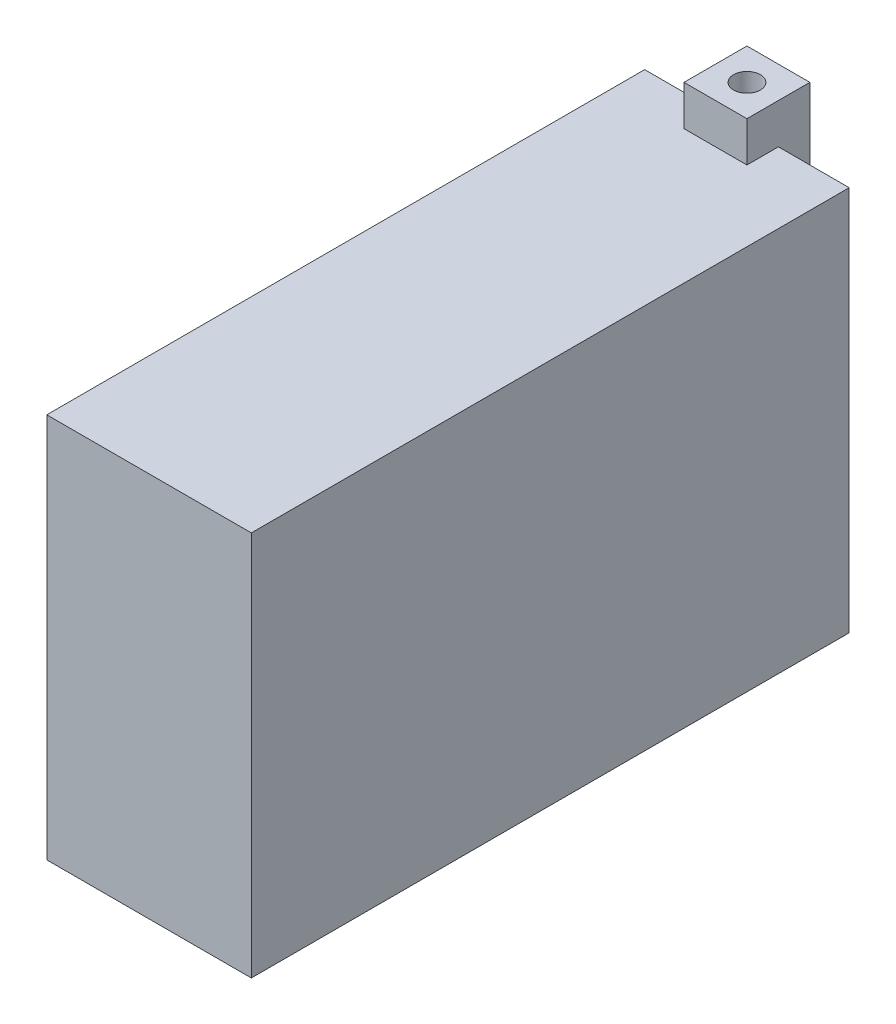
ISO-10303-21;
HEADER;
FILE_DESCRIPTION(('STEP AP214'),'2;1');
FILE_NAME('part.step','',(''),(''),'','','');
FILE_SCHEMA(('AUTOMOTIVE_DESIGN { 1 0 10303 214 1 1 1 1 }'));
ENDSEC;
DATA;
#1=APPLICATION_CONTEXT('core data for automotive mechanical design processes');
#2=APPLICATION_PROTOCOL_DEFINITION('international standard','automotive_design',2000,#1);
#3=PRODUCT_CONTEXT('',#1,'mechanical');
#4=PRODUCT('Part','Part','',(#3));
#5=PRODUCT_RELATED_PRODUCT_CATEGORY('part','',(#4));
#6=PRODUCT_DEFINITION_FORMATION('','',#4);
#7=PRODUCT_DEFINITION_CONTEXT('part definition',#1,'design');
#8=PRODUCT_DEFINITION('design','',#6,#7);
#9=PRODUCT_DEFINITION_SHAPE('','',#8);
#10=(LENGTH_UNIT() NAMED_UNIT(*) SI_UNIT(.MILLI.,.METRE.));
#11=(NAMED_UNIT(*) PLANE_ANGLE_UNIT() SI_UNIT($,.RADIAN.));
#12=(NAMED_UNIT(*) SI_UNIT($,.STERADIAN.) SOLID_ANGLE_UNIT());
#13=UNCERTAINTY_MEASURE_WITH_UNIT(LENGTH_MEASURE(1.E-05),#10,'distance_accuracy_value','');
#14=(GEOMETRIC_REPRESENTATION_CONTEXT(3) GLOBAL_UNCERTAINTY_ASSIGNED_CONTEXT((#13)) GLOBAL_UNIT_ASSIGNED_CONTEXT((#10,
#11,#12)) REPRESENTATION_CONTEXT('',''));
#15=CARTESIAN_POINT('',(0.,0.,0.));
#16=DIRECTION('',(0.,0.,1.));
#17=DIRECTION('',(1.,0.,0.));
#18=AXIS2_PLACEMENT_3D('',#15,#16,#17);
#19=CARTESIAN_POINT('',(-65.,-122.5,-190.));
#20=DIRECTION('',(0.,0.,-1.));
#21=DIRECTION('',(-1.,0.,0.));
#22=AXIS2_PLACEMENT_3D('',#19,#20,#21);
#23=PLANE('',#22);
#24=DIRECTION('',(0.,-1.,0.));
#25=VECTOR('',#24,1.);
#26=CARTESIAN_POINT('',(8.50000000000005,172.041630560343,-190.));
#27=LINE('',#26,#25);
#28=CARTESIAN_POINT('',(8.50000000000005,88.,-190.));
#29=VERTEX_POINT('',#28);
#30=CARTESIAN_POINT('',(8.50000000000005,-88.,-190.));
#31=VERTEX_POINT('',#30);
#32=EDGE_CURVE('E163',#29,#31,#27,.T.);
#33=ORIENTED_EDGE('',*,*,#32,.F.);
#34=DIRECTION('',(-1.,0.,0.));
#35=VECTOR('',#34,1.);
#36=CARTESIAN_POINT('',(-20.,88.,-190.));
#37=LINE('',#36,#35);
#38=CARTESIAN_POINT('',(20.,88.,-190.));
#39=VERTEX_POINT('',#38);
#40=EDGE_CURVE('E171',#39,#29,#37,.T.);
#41=ORIENTED_EDGE('',*,*,#40,.F.);
#42=DIRECTION('',(0.,-1.,0.));
#43=VECTOR('',#42,1.);
#44=CARTESIAN_POINT('',(20.,148.,-190.));
#45=LINE('',#44,#43);
#46=CARTESIAN_POINT('',(20.,122.5,-190.));
#47=VERTEX_POINT('',#46);
#48=EDGE_CURVE('E182',#47,#39,#45,.T.);
#49=ORIENTED_EDGE('',*,*,#48,.F.);
#50=DIRECTION('',(1.,0.,0.));
#51=VECTOR('',#50,1.);
#52=CARTESIAN_POINT('',(-65.,122.5,-190.));
#53=LINE('',#52,#51);
#54=CARTESIAN_POINT('',(65.,122.5,-190.));
#55=VERTEX_POINT('',#54);
#56=EDGE_CURVE('E283',#47,#55,#53,.T.);
#57=ORIENTED_EDGE('',*,*,#56,.T.);
#58=DIRECTION('',(0.,1.,0.));
#59=VECTOR('',#58,1.);
#60=CARTESIAN_POINT('',(65.,-122.5,-190.));
#61=LINE('',#60,#59);
#62=CARTESIAN_POINT('',(65.,-122.5,-190.));
#63=VERTEX_POINT('',#62);
#64=EDGE_CURVE('E258',#63,#55,#61,.T.);
#65=ORIENTED_EDGE('',*,*,#64,.F.);
#66=DIRECTION('',(1.,0.,0.));
#67=VECTOR('',#66,1.);
#68=CARTESIAN_POINT('',(-65.,-122.5,-190.));
#69=LINE('',#68,#67);
#70=CARTESIAN_POINT('',(20.,-122.5,-190.));
#71=VERTEX_POINT('',#70);
#72=EDGE_CURVE('E286',#71,#63,#69,.T.);
#73=ORIENTED_EDGE('',*,*,#72,.F.);
#74=DIRECTION('',(0.,1.,0.));
#75=VECTOR('',#74,1.);
#76=CARTESIAN_POINT('',(20.,-148.,-190.));
#77=LINE('',#76,#75);
#78=CARTESIAN_POINT('',(20.,-88.,-190.));
#79=VERTEX_POINT('',#78);
#80=EDGE_CURVE('E46',#71,#79,#77,.T.);
#81=ORIENTED_EDGE('',*,*,#80,.T.);
#82=DIRECTION('',(-1.,0.,0.));
#83=VECTOR('',#82,1.);
#84=CARTESIAN_POINT('',(-20.,-88.,-190.));
#85=LINE('',#84,#83);
#86=EDGE_CURVE('E174',#79,#31,#85,.T.);
#87=ORIENTED_EDGE('',*,*,#86,.T.);
#88=EDGE_LOOP('',(#33,#41,#49,#57,#65,#73,#81,#87));
#89=FACE_BOUND('',#88,.T.);
#90=ADVANCED_FACE('F38',(#89),#23,.T.);
#91=DIRECTION('',(0.,-1.,0.));
#92=VECTOR('',#91,1.);
#93=CARTESIAN_POINT('',(-8.49999999999996,172.041630560343,-190.));
#94=LINE('',#93,#92);
#95=CARTESIAN_POINT('',(-8.49999999999996,-88.,-190.));
#96=VERTEX_POINT('',#95);
#97=CARTESIAN_POINT('',(-8.49999999999996,88.,-190.));
#98=VERTEX_POINT('',#97);
#99=EDGE_CURVE('E53',#96,#98,#94,.F.);
#100=ORIENTED_EDGE('',*,*,#99,.F.);
#101=CARTESIAN_POINT('',(-20.,-88.,-190.));
#102=VERTEX_POINT('',#101);
#103=EDGE_CURVE('E229',#96,#102,#85,.T.);
#104=ORIENTED_EDGE('',*,*,#103,.T.);
#105=DIRECTION('',(0.,-1.,0.));
#106=VECTOR('',#105,1.);
#107=CARTESIAN_POINT('',(-20.,-148.,-190.));
#108=LINE('',#107,#106);
#109=CARTESIAN_POINT('',(-20.,-122.5,-190.));
#110=VERTEX_POINT('',#109);
#111=EDGE_CURVE('E212',#102,#110,#108,.T.);
#112=ORIENTED_EDGE('',*,*,#111,.T.);
#113=CARTESIAN_POINT('',(-65.,-122.5,-190.));
#114=VERTEX_POINT('',#113);
#115=EDGE_CURVE('E231',#114,#110,#69,.T.);
#116=ORIENTED_EDGE('',*,*,#115,.F.);
#117=DIRECTION('',(0.,1.,0.));
#118=VECTOR('',#117,1.);
#119=CARTESIAN_POINT('',(-65.,-122.5,-190.));
#120=LINE('',#119,#118);
#121=CARTESIAN_POINT('',(-65.,122.5,-190.));
#122=VERTEX_POINT('',#121);
#123=EDGE_CURVE('E271',#114,#122,#120,.T.);
#124=ORIENTED_EDGE('',*,*,#123,.T.);
#125=CARTESIAN_POINT('',(-20.,122.5,-190.));
#126=VERTEX_POINT('',#125);
#127=EDGE_CURVE('E290',#122,#126,#53,.T.);
#128=ORIENTED_EDGE('',*,*,#127,.T.);
#129=DIRECTION('',(0.,1.,0.));
#130=VECTOR('',#129,1.);
#131=CARTESIAN_POINT('',(-20.,148.,-190.));
#132=LINE('',#131,#130);
#133=CARTESIAN_POINT('',(-20.,88.,-190.));
#134=VERTEX_POINT('',#133);
#135=EDGE_CURVE('E187',#134,#126,#132,.T.);
#136=ORIENTED_EDGE('',*,*,#135,.F.);
#137=EDGE_CURVE('E183',#98,#134,#37,.T.);
#138=ORIENTED_EDGE('',*,*,#137,.F.);
#139=EDGE_LOOP('',(#100,#104,#112,#116,#124,#128,#136,#138));
#140=FACE_BOUND('',#139,.T.);
#141=ADVANCED_FACE('F40',(#140),#23,.T.);
#142=CARTESIAN_POINT('',(-65.,-122.5,190.));
#143=DIRECTION('',(0.,-1.,0.));
#144=DIRECTION('',(0.,0.,-1.));
#145=AXIS2_PLACEMENT_3D('',#142,#143,#144);
#146=PLANE('',#145);
#147=DIRECTION('',(1.,0.,0.));
#148=VECTOR('',#147,1.);
#149=CARTESIAN_POINT('',(20.,-122.5,-170.));
#150=LINE('',#149,#148);
#151=CARTESIAN_POINT('',(-20.,-122.5,-170.));
#152=VERTEX_POINT('',#151);
#153=CARTESIAN_POINT('',(20.,-122.5,-170.));
#154=VERTEX_POINT('',#153);
#155=EDGE_CURVE('E241',#152,#154,#150,.T.);
#156=ORIENTED_EDGE('',*,*,#155,.T.);
#157=DIRECTION('',(0.,0.,-1.));
#158=VECTOR('',#157,1.);
#159=CARTESIAN_POINT('',(20.,-122.5,-190.));
#160=LINE('',#159,#158);
#161=EDGE_CURVE('E236',#154,#71,#160,.T.);
#162=ORIENTED_EDGE('',*,*,#161,.T.);
#163=ORIENTED_EDGE('',*,*,#72,.T.);
#164=DIRECTION('',(0.,0.,-1.));
#165=VECTOR('',#164,1.);
#166=CARTESIAN_POINT('',(65.,-122.5,190.));
#167=LINE('',#166,#165);
#168=CARTESIAN_POINT('',(65.,-122.5,190.));
#169=VERTEX_POINT('',#168);
#170=EDGE_CURVE('E268',#169,#63,#167,.T.);
#171=ORIENTED_EDGE('',*,*,#170,.F.);
#172=DIRECTION('',(1.,0.,0.));
#173=VECTOR('',#172,1.);
#174=CARTESIAN_POINT('',(-65.,-122.5,190.));
#175=LINE('',#174,#173);
#176=CARTESIAN_POINT('',(-65.,-122.5,190.));
#177=VERTEX_POINT('',#176);
#178=EDGE_CURVE('E287',#177,#169,#175,.T.);
#179=ORIENTED_EDGE('',*,*,#178,.F.);
#180=DIRECTION('',(0.,0.,-1.));
#181=VECTOR('',#180,1.);
#182=CARTESIAN_POINT('',(-65.,-122.5,190.));
#183=LINE('',#182,#181);
#184=EDGE_CURVE('E280',#177,#114,#183,.T.);
#185=ORIENTED_EDGE('',*,*,#184,.T.);
#186=ORIENTED_EDGE('',*,*,#115,.T.);
#187=DIRECTION('',(0.,0.,1.));
#188=VECTOR('',#187,1.);
#189=CARTESIAN_POINT('',(-20.,-122.5,-190.));
#190=LINE('',#189,#188);
#191=EDGE_CURVE('E250',#110,#152,#190,.T.);
#192=ORIENTED_EDGE('',*,*,#191,.T.);
#193=EDGE_LOOP('',(#156,#162,#163,#171,#179,#185,#186,#192));
#194=FACE_BOUND('',#193,.T.);
#195=ADVANCED_FACE('F303',(#194),#146,.T.);
#196=CARTESIAN_POINT('',(-65.,-122.5,190.));
#197=DIRECTION('',(0.,0.,1.));
#198=DIRECTION('',(1.,0.,0.));
#199=AXIS2_PLACEMENT_3D('',#196,#197,#198);
#200=PLANE('',#199);
#201=ORIENTED_EDGE('',*,*,#178,.T.);
#202=DIRECTION('',(0.,-1.,0.));
#203=VECTOR('',#202,1.);
#204=CARTESIAN_POINT('',(65.,-122.5,190.));
#205=LINE('',#204,#203);
#206=CARTESIAN_POINT('',(65.,122.5,190.));
#207=VERTEX_POINT('',#206);
#208=EDGE_CURVE('E265',#207,#169,#205,.T.);
#209=ORIENTED_EDGE('',*,*,#208,.F.);
#210=DIRECTION('',(1.,0.,0.));
#211=VECTOR('',#210,1.);
#212=CARTESIAN_POINT('',(-65.,122.5,190.));
#213=LINE('',#212,#211);
#214=CARTESIAN_POINT('',(-65.,122.5,190.));
#215=VERTEX_POINT('',#214);
#216=EDGE_CURVE('E289',#215,#207,#213,.T.);
#217=ORIENTED_EDGE('',*,*,#216,.F.);
#218=DIRECTION('',(0.,-1.,0.));
#219=VECTOR('',#218,1.);
#220=CARTESIAN_POINT('',(-65.,-122.5,190.));
#221=LINE('',#220,#219);
#222=EDGE_CURVE('E277',#215,#177,#221,.T.);
#223=ORIENTED_EDGE('',*,*,#222,.T.);
#224=EDGE_LOOP('',(#201,#209,#217,#223));
#225=FACE_BOUND('',#224,.T.);
#226=ADVANCED_FACE('F372',(#225),#200,.T.);
#227=CARTESIAN_POINT('',(-65.,122.5,190.));
#228=DIRECTION('',(0.,1.,0.));
#229=DIRECTION('',(0.,0.,1.));
#230=AXIS2_PLACEMENT_3D('',#227,#228,#229);
#231=PLANE('',#230);
#232=DIRECTION('',(0.,0.,-1.));
#233=VECTOR('',#232,1.);
#234=CARTESIAN_POINT('',(20.,122.5,-190.));
#235=LINE('',#234,#233);
#236=CARTESIAN_POINT('',(20.,122.5,-170.));
#237=VERTEX_POINT('',#236);
#238=EDGE_CURVE('E60',#237,#47,#235,.T.);
#239=ORIENTED_EDGE('',*,*,#238,.F.);
#240=DIRECTION('',(1.,0.,0.));
#241=VECTOR('',#240,1.);
#242=CARTESIAN_POINT('',(20.,122.5,-170.));
#243=LINE('',#242,#241);
#244=CARTESIAN_POINT('',(-20.,122.5,-170.));
#245=VERTEX_POINT('',#244);
#246=EDGE_CURVE('E205',#245,#237,#243,.T.);
#247=ORIENTED_EDGE('',*,*,#246,.F.);
#248=DIRECTION('',(0.,0.,1.));
#249=VECTOR('',#248,1.);
#250=CARTESIAN_POINT('',(-20.,122.5,-190.));
#251=LINE('',#250,#249);
#252=EDGE_CURVE('E199',#126,#245,#251,.T.);
#253=ORIENTED_EDGE('',*,*,#252,.F.);
#254=ORIENTED_EDGE('',*,*,#127,.F.);
#255=DIRECTION('',(0.,0.,1.));
#256=VECTOR('',#255,1.);
#257=CARTESIAN_POINT('',(-65.,122.5,190.));
#258=LINE('',#257,#256);
#259=EDGE_CURVE('E274',#122,#215,#258,.T.);
#260=ORIENTED_EDGE('',*,*,#259,.T.);
#261=ORIENTED_EDGE('',*,*,#216,.T.);
#262=DIRECTION('',(0.,0.,1.));
#263=VECTOR('',#262,1.);
#264=CARTESIAN_POINT('',(65.,122.5,190.));
#265=LINE('',#264,#263);
#266=EDGE_CURVE('E262',#55,#207,#265,.T.);
#267=ORIENTED_EDGE('',*,*,#266,.F.);
#268=ORIENTED_EDGE('',*,*,#56,.F.);
#269=EDGE_LOOP('',(#239,#247,#253,#254,#260,#261,#267,#268));
#270=FACE_BOUND('',#269,.T.);
#271=ADVANCED_FACE('F297',(#270),#231,.T.);
#272=CARTESIAN_POINT('',(-65.,0.,0.));
#273=DIRECTION('',(-1.,0.,0.));
#274=DIRECTION('',(0.,0.,1.));
#275=AXIS2_PLACEMENT_3D('',#272,#273,#274);
#276=PLANE('',#275);
#277=ORIENTED_EDGE('',*,*,#123,.F.);
#278=ORIENTED_EDGE('',*,*,#184,.F.);
#279=ORIENTED_EDGE('',*,*,#222,.F.);
#280=ORIENTED_EDGE('',*,*,#259,.F.);
#281=EDGE_LOOP('',(#277,#278,#279,#280));
#282=FACE_BOUND('',#281,.T.);
#283=ADVANCED_FACE('F369',(#282),#276,.T.);
#284=CARTESIAN_POINT('',(65.,0.,0.));
#285=DIRECTION('',(-1.,0.,0.));
#286=DIRECTION('',(0.,0.,1.));
#287=AXIS2_PLACEMENT_3D('',#284,#285,#286);
#288=PLANE('',#287);
#289=ORIENTED_EDGE('',*,*,#64,.T.);
#290=ORIENTED_EDGE('',*,*,#266,.T.);
#291=ORIENTED_EDGE('',*,*,#208,.T.);
#292=ORIENTED_EDGE('',*,*,#170,.T.);
#293=EDGE_LOOP('',(#289,#290,#291,#292));
#294=FACE_BOUND('',#293,.T.);
#295=ADVANCED_FACE('F300',(#294),#288,.F.);
#296=CARTESIAN_POINT('',(20.,-148.,-190.));
#297=DIRECTION('',(1.,0.,0.));
#298=DIRECTION('',(0.,0.,-1.));
#299=AXIS2_PLACEMENT_3D('',#296,#297,#298);
#300=PLANE('',#299);
#301=ORIENTED_EDGE('',*,*,#161,.F.);
#302=DIRECTION('',(0.,1.,0.));
#303=VECTOR('',#302,1.);
#304=CARTESIAN_POINT('',(20.,-148.,-170.));
#305=LINE('',#304,#303);
#306=CARTESIAN_POINT('',(20.,-148.,-170.));
#307=VERTEX_POINT('',#306);
#308=EDGE_CURVE('E255',#307,#154,#305,.T.);
#309=ORIENTED_EDGE('',*,*,#308,.F.);
#310=DIRECTION('',(0.,0.,-1.));
#311=VECTOR('',#310,1.);
#312=CARTESIAN_POINT('',(20.,-148.,-190.));
#313=LINE('',#312,#311);
#314=CARTESIAN_POINT('',(20.,-148.,-210.));
#315=VERTEX_POINT('',#314);
#316=EDGE_CURVE('E238',#307,#315,#313,.T.);
#317=ORIENTED_EDGE('',*,*,#316,.T.);
#318=DIRECTION('',(0.,1.,0.));
#319=VECTOR('',#318,1.);
#320=CARTESIAN_POINT('',(20.,-148.,-210.));
#321=LINE('',#320,#319);
#322=CARTESIAN_POINT('',(20.,-88.,-210.));
#323=VERTEX_POINT('',#322);
#324=EDGE_CURVE('E221',#315,#323,#321,.T.);
#325=ORIENTED_EDGE('',*,*,#324,.T.);
#326=DIRECTION('',(0.,0.,1.));
#327=VECTOR('',#326,1.);
#328=CARTESIAN_POINT('',(20.,-88.,-210.));
#329=LINE('',#328,#327);
#330=EDGE_CURVE('E227',#323,#79,#329,.T.);
#331=ORIENTED_EDGE('',*,*,#330,.T.);
#332=ORIENTED_EDGE('',*,*,#80,.F.);
#333=EDGE_LOOP('',(#301,#309,#317,#325,#331,#332));
#334=FACE_BOUND('',#333,.T.);
#335=ADVANCED_FACE('F305',(#334),#300,.T.);
#336=CARTESIAN_POINT('',(20.,-148.,-170.));
#337=DIRECTION('',(0.,0.,1.));
#338=DIRECTION('',(1.,0.,0.));
#339=AXIS2_PLACEMENT_3D('',#336,#337,#338);
#340=PLANE('',#339);
#341=ORIENTED_EDGE('',*,*,#155,.F.);
#342=DIRECTION('',(0.,1.,0.));
#343=VECTOR('',#342,1.);
#344=CARTESIAN_POINT('',(-20.,-148.,-170.));
#345=LINE('',#344,#343);
#346=CARTESIAN_POINT('',(-20.,-148.,-170.));
#347=VERTEX_POINT('',#346);
#348=EDGE_CURVE('E247',#347,#152,#345,.T.);
#349=ORIENTED_EDGE('',*,*,#348,.F.);
#350=DIRECTION('',(1.,0.,0.));
#351=VECTOR('',#350,1.);
#352=CARTESIAN_POINT('',(20.,-148.,-170.));
#353=LINE('',#352,#351);
#354=EDGE_CURVE('E244',#347,#307,#353,.T.);
#355=ORIENTED_EDGE('',*,*,#354,.T.);
#356=ORIENTED_EDGE('',*,*,#308,.T.);
#357=EDGE_LOOP('',(#341,#349,#355,#356));
#358=FACE_BOUND('',#357,.T.);
#359=ADVANCED_FACE('F359',(#358),#340,.T.);
#360=CARTESIAN_POINT('',(-20.,-148.,-190.));
#361=DIRECTION('',(-1.,0.,0.));
#362=DIRECTION('',(0.,0.,1.));
#363=AXIS2_PLACEMENT_3D('',#360,#361,#362);
#364=PLANE('',#363);
#365=ORIENTED_EDGE('',*,*,#191,.F.);
#366=ORIENTED_EDGE('',*,*,#111,.F.);
#367=DIRECTION('',(0.,0.,1.));
#368=VECTOR('',#367,1.);
#369=CARTESIAN_POINT('',(-20.,-88.,-210.));
#370=LINE('',#369,#368);
#371=CARTESIAN_POINT('',(-20.,-88.,-210.));
#372=VERTEX_POINT('',#371);
#373=EDGE_CURVE('E233',#372,#102,#370,.T.);
#374=ORIENTED_EDGE('',*,*,#373,.F.);
#375=DIRECTION('',(0.,-1.,0.));
#376=VECTOR('',#375,1.);
#377=CARTESIAN_POINT('',(-20.,-148.,-210.));
#378=LINE('',#377,#376);
#379=CARTESIAN_POINT('',(-20.,-148.,-210.));
#380=VERTEX_POINT('',#379);
#381=EDGE_CURVE('E215',#372,#380,#378,.T.);
#382=ORIENTED_EDGE('',*,*,#381,.T.);
#383=DIRECTION('',(0.,0.,1.));
#384=VECTOR('',#383,1.);
#385=CARTESIAN_POINT('',(-20.,-148.,-190.));
#386=LINE('',#385,#384);
#387=EDGE_CURVE('E240',#380,#347,#386,.T.);
#388=ORIENTED_EDGE('',*,*,#387,.T.);
#389=ORIENTED_EDGE('',*,*,#348,.T.);
#390=EDGE_LOOP('',(#365,#366,#374,#382,#388,#389));
#391=FACE_BOUND('',#390,.T.);
#392=ADVANCED_FACE('F352',(#391),#364,.T.);
#393=CARTESIAN_POINT('',(0.,-148.,0.));
#394=DIRECTION('',(0.,-1.,0.));
#395=DIRECTION('',(0.,0.,-1.));
#396=AXIS2_PLACEMENT_3D('',#393,#394,#395);
#397=PLANE('',#396);
#398=CARTESIAN_POINT('',(0.,-148.,-190.));
#399=DIRECTION('',(0.,-1.,0.));
#400=DIRECTION('',(0.,0.,-1.));
#401=AXIS2_PLACEMENT_3D('',#398,#399,#400);
#402=CIRCLE('',#401,8.5);
#403=CARTESIAN_POINT('',(0.,-148.,-198.5));
#404=VERTEX_POINT('',#403);
#405=EDGE_CURVE('E342',#404,#404,#402,.T.);
#406=ORIENTED_EDGE('',*,*,#405,.F.);
#407=EDGE_LOOP('',(#406));
#408=FACE_BOUND('',#407,.T.);
#409=ORIENTED_EDGE('',*,*,#316,.F.);
#410=ORIENTED_EDGE('',*,*,#354,.F.);
#411=ORIENTED_EDGE('',*,*,#387,.F.);
#412=DIRECTION('',(1.,0.,0.));
#413=VECTOR('',#412,1.);
#414=CARTESIAN_POINT('',(-20.,-148.,-210.));
#415=LINE('',#414,#413);
#416=EDGE_CURVE('E218',#380,#315,#415,.T.);
#417=ORIENTED_EDGE('',*,*,#416,.T.);
#418=EDGE_LOOP('',(#409,#410,#411,#417));
#419=FACE_BOUND('',#418,.T.);
#420=ADVANCED_FACE('F349',(#408,#419),#397,.T.);
#421=CARTESIAN_POINT('',(-20.,-88.,-210.));
#422=DIRECTION('',(0.,1.,0.));
#423=DIRECTION('',(0.,0.,1.));
#424=AXIS2_PLACEMENT_3D('',#421,#422,#423);
#425=PLANE('',#424);
#426=CARTESIAN_POINT('',(0.,-88.,-190.));
#427=DIRECTION('',(0.,1.,0.));
#428=DIRECTION('',(0.,0.,1.));
#429=AXIS2_PLACEMENT_3D('',#426,#427,#428);
#430=CIRCLE('',#429,8.5);
#431=EDGE_CURVE('E175',#31,#96,#430,.T.);
#432=ORIENTED_EDGE('',*,*,#431,.F.);
#433=ORIENTED_EDGE('',*,*,#86,.F.);
#434=ORIENTED_EDGE('',*,*,#330,.F.);
#435=DIRECTION('',(-1.,0.,0.));
#436=VECTOR('',#435,1.);
#437=CARTESIAN_POINT('',(-20.,-88.,-210.));
#438=LINE('',#437,#436);
#439=EDGE_CURVE('E224',#323,#372,#438,.T.);
#440=ORIENTED_EDGE('',*,*,#439,.T.);
#441=ORIENTED_EDGE('',*,*,#373,.T.);
#442=ORIENTED_EDGE('',*,*,#103,.F.);
#443=EDGE_LOOP('',(#432,#433,#434,#440,#441,#442));
#444=FACE_BOUND('',#443,.T.);
#445=ADVANCED_FACE('F309',(#444),#425,.T.);
#446=CARTESIAN_POINT('',(0.,0.,-210.));
#447=DIRECTION('',(0.,0.,-1.));
#448=DIRECTION('',(-1.,0.,0.));
#449=AXIS2_PLACEMENT_3D('',#446,#447,#448);
#450=PLANE('',#449);
#451=ORIENTED_EDGE('',*,*,#381,.F.);
#452=ORIENTED_EDGE('',*,*,#439,.F.);
#453=ORIENTED_EDGE('',*,*,#324,.F.);
#454=ORIENTED_EDGE('',*,*,#416,.F.);
#455=EDGE_LOOP('',(#451,#452,#453,#454));
#456=FACE_BOUND('',#455,.T.);
#457=ADVANCED_FACE('F364',(#456),#450,.T.);
#458=CARTESIAN_POINT('',(20.,148.,-190.));
#459=DIRECTION('',(-1.,0.,0.));
#460=DIRECTION('',(0.,0.,1.));
#461=AXIS2_PLACEMENT_3D('',#458,#459,#460);
#462=PLANE('',#461);
#463=ORIENTED_EDGE('',*,*,#238,.T.);
#464=ORIENTED_EDGE('',*,*,#48,.T.);
#465=DIRECTION('',(0.,0.,1.));
#466=VECTOR('',#465,1.);
#467=CARTESIAN_POINT('',(20.,88.,-210.));
#468=LINE('',#467,#466);
#469=CARTESIAN_POINT('',(20.,88.,-210.));
#470=VERTEX_POINT('',#469);
#471=EDGE_CURVE('E181',#470,#39,#468,.T.);
#472=ORIENTED_EDGE('',*,*,#471,.F.);
#473=DIRECTION('',(0.,-1.,0.));
#474=VECTOR('',#473,1.);
#475=CARTESIAN_POINT('',(20.,148.,-210.));
#476=LINE('',#475,#474);
#477=CARTESIAN_POINT('',(20.,148.,-210.));
#478=VERTEX_POINT('',#477);
#479=EDGE_CURVE('E318',#478,#470,#476,.T.);
#480=ORIENTED_EDGE('',*,*,#479,.F.);
#481=DIRECTION('',(0.,0.,-1.));
#482=VECTOR('',#481,1.);
#483=CARTESIAN_POINT('',(20.,148.,-190.));
#484=LINE('',#483,#482);
#485=CARTESIAN_POINT('',(20.,148.,-170.));
#486=VERTEX_POINT('',#485);
#487=EDGE_CURVE('E196',#486,#478,#484,.T.);
#488=ORIENTED_EDGE('',*,*,#487,.F.);
#489=DIRECTION('',(0.,-1.,0.));
#490=VECTOR('',#489,1.);
#491=CARTESIAN_POINT('',(20.,148.,-170.));
#492=LINE('',#491,#490);
#493=EDGE_CURVE('E203',#486,#237,#492,.T.);
#494=ORIENTED_EDGE('',*,*,#493,.T.);
#495=EDGE_LOOP('',(#463,#464,#472,#480,#488,#494));
#496=FACE_BOUND('',#495,.T.);
#497=ADVANCED_FACE('F328',(#496),#462,.F.);
#498=CARTESIAN_POINT('',(-20.,148.,-190.));
#499=DIRECTION('',(1.,0.,0.));
#500=DIRECTION('',(0.,0.,-1.));
#501=AXIS2_PLACEMENT_3D('',#498,#499,#500);
#502=PLANE('',#501);
#503=ORIENTED_EDGE('',*,*,#252,.T.);
#504=DIRECTION('',(0.,-1.,0.));
#505=VECTOR('',#504,1.);
#506=CARTESIAN_POINT('',(-20.,148.,-170.));
#507=LINE('',#506,#505);
#508=CARTESIAN_POINT('',(-20.,148.,-170.));
#509=VERTEX_POINT('',#508);
#510=EDGE_CURVE('E209',#509,#245,#507,.T.);
#511=ORIENTED_EDGE('',*,*,#510,.F.);
#512=DIRECTION('',(0.,0.,1.));
#513=VECTOR('',#512,1.);
#514=CARTESIAN_POINT('',(-20.,148.,-190.));
#515=LINE('',#514,#513);
#516=CARTESIAN_POINT('',(-20.,148.,-210.));
#517=VERTEX_POINT('',#516);
#518=EDGE_CURVE('E201',#517,#509,#515,.T.);
#519=ORIENTED_EDGE('',*,*,#518,.F.);
#520=DIRECTION('',(0.,1.,0.));
#521=VECTOR('',#520,1.);
#522=CARTESIAN_POINT('',(-20.,148.,-210.));
#523=LINE('',#522,#521);
#524=CARTESIAN_POINT('',(-20.,88.,-210.));
#525=VERTEX_POINT('',#524);
#526=EDGE_CURVE('E185',#525,#517,#523,.T.);
#527=ORIENTED_EDGE('',*,*,#526,.F.);
#528=DIRECTION('',(0.,0.,1.));
#529=VECTOR('',#528,1.);
#530=CARTESIAN_POINT('',(-20.,88.,-210.));
#531=LINE('',#530,#529);
#532=EDGE_CURVE('E192',#525,#134,#531,.T.);
#533=ORIENTED_EDGE('',*,*,#532,.T.);
#534=ORIENTED_EDGE('',*,*,#135,.T.);
#535=EDGE_LOOP('',(#503,#511,#519,#527,#533,#534));
#536=FACE_BOUND('',#535,.T.);
#537=ADVANCED_FACE('F331',(#536),#502,.F.);
#538=CARTESIAN_POINT('',(20.,148.,-170.));
#539=DIRECTION('',(0.,0.,-1.));
#540=DIRECTION('',(-1.,0.,0.));
#541=AXIS2_PLACEMENT_3D('',#538,#539,#540);
#542=PLANE('',#541);
#543=ORIENTED_EDGE('',*,*,#246,.T.);
#544=ORIENTED_EDGE('',*,*,#493,.F.);
#545=DIRECTION('',(1.,0.,0.));
#546=VECTOR('',#545,1.);
#547=CARTESIAN_POINT('',(20.,148.,-170.));
#548=LINE('',#547,#546);
#549=EDGE_CURVE('E198',#509,#486,#548,.T.);
#550=ORIENTED_EDGE('',*,*,#549,.F.);
#551=ORIENTED_EDGE('',*,*,#510,.T.);
#552=EDGE_LOOP('',(#543,#544,#550,#551));
#553=FACE_BOUND('',#552,.T.);
#554=ADVANCED_FACE('F337',(#553),#542,.F.);
#555=CARTESIAN_POINT('',(0.,148.,0.));
#556=DIRECTION('',(0.,1.,0.));
#557=DIRECTION('',(0.,0.,-1.));
#558=AXIS2_PLACEMENT_3D('',#555,#556,#557);
#559=PLANE('',#558);
#560=CARTESIAN_POINT('',(0.,148.,-190.));
#561=DIRECTION('',(0.,1.,0.));
#562=DIRECTION('',(0.,0.,1.));
#563=AXIS2_PLACEMENT_3D('',#560,#561,#562);
#564=CIRCLE('',#563,8.5);
#565=CARTESIAN_POINT('',(0.,148.,-181.5));
#566=VERTEX_POINT('',#565);
#567=EDGE_CURVE('E340',#566,#566,#564,.F.);
#568=ORIENTED_EDGE('',*,*,#567,.T.);
#569=EDGE_LOOP('',(#568));
#570=FACE_BOUND('',#569,.T.);
#571=ORIENTED_EDGE('',*,*,#487,.T.);
#572=DIRECTION('',(1.,0.,0.));
#573=VECTOR('',#572,1.);
#574=CARTESIAN_POINT('',(-20.,148.,-210.));
#575=LINE('',#574,#573);
#576=EDGE_CURVE('E195',#517,#478,#575,.T.);
#577=ORIENTED_EDGE('',*,*,#576,.F.);
#578=ORIENTED_EDGE('',*,*,#518,.T.);
#579=ORIENTED_EDGE('',*,*,#549,.T.);
#580=EDGE_LOOP('',(#571,#577,#578,#579));
#581=FACE_BOUND('',#580,.T.);
#582=ADVANCED_FACE('F334',(#570,#581),#559,.T.);
#583=CARTESIAN_POINT('',(-20.,88.,-210.));
#584=DIRECTION('',(0.,1.,0.));
#585=DIRECTION('',(0.,0.,1.));
#586=AXIS2_PLACEMENT_3D('',#583,#584,#585);
#587=PLANE('',#586);
#588=ORIENTED_EDGE('',*,*,#40,.T.);
#589=CARTESIAN_POINT('',(0.,88.,-190.));
#590=DIRECTION('',(0.,1.,0.));
#591=DIRECTION('',(0.,0.,1.));
#592=AXIS2_PLACEMENT_3D('',#589,#590,#591);
#593=CIRCLE('',#592,8.5);
#594=EDGE_CURVE('E11',#29,#98,#593,.T.);
#595=ORIENTED_EDGE('',*,*,#594,.T.);
#596=ORIENTED_EDGE('',*,*,#137,.T.);
#597=ORIENTED_EDGE('',*,*,#532,.F.);
#598=DIRECTION('',(-1.,0.,0.));
#599=VECTOR('',#598,1.);
#600=CARTESIAN_POINT('',(-20.,88.,-210.));
#601=LINE('',#600,#599);
#602=EDGE_CURVE('E316',#470,#525,#601,.T.);
#603=ORIENTED_EDGE('',*,*,#602,.F.);
#604=ORIENTED_EDGE('',*,*,#471,.T.);
#605=EDGE_LOOP('',(#588,#595,#596,#597,#603,#604));
#606=FACE_BOUND('',#605,.T.);
#607=ADVANCED_FACE('F178',(#606),#587,.F.);
#608=CARTESIAN_POINT('',(0.,0.,-210.));
#609=DIRECTION('',(0.,0.,-1.));
#610=DIRECTION('',(-1.,0.,0.));
#611=AXIS2_PLACEMENT_3D('',#608,#609,#610);
#612=PLANE('',#611);
#613=ORIENTED_EDGE('',*,*,#526,.T.);
#614=ORIENTED_EDGE('',*,*,#576,.T.);
#615=ORIENTED_EDGE('',*,*,#479,.T.);
#616=ORIENTED_EDGE('',*,*,#602,.T.);
#617=EDGE_LOOP('',(#613,#614,#615,#616));
#618=FACE_BOUND('',#617,.T.);
#619=ADVANCED_FACE('F323',(#618),#612,.T.);
#620=CARTESIAN_POINT('',(0.,172.041630560343,-190.));
#621=DIRECTION('',(0.,-1.,0.));
#622=DIRECTION('',(0.,0.,-1.));
#623=AXIS2_PLACEMENT_3D('',#620,#621,#622);
#624=CYLINDRICAL_SURFACE('',#623,8.5);
#625=ORIENTED_EDGE('',*,*,#431,.T.);
#626=ORIENTED_EDGE('',*,*,#99,.T.);
#627=ORIENTED_EDGE('',*,*,#594,.F.);
#628=ORIENTED_EDGE('',*,*,#32,.T.);
#629=EDGE_LOOP('',(#625,#626,#627,#628));
#630=FACE_BOUND('',#629,.T.);
#631=ORIENTED_EDGE('',*,*,#405,.T.);
#632=EDGE_LOOP('',(#631));
#633=FACE_BOUND('',#632,.T.);
#634=ORIENTED_EDGE('',*,*,#567,.F.);
#635=EDGE_LOOP('',(#634));
#636=FACE_BOUND('',#635,.T.);
#637=ADVANCED_FACE('F161',(#630,#633,#636),#624,.F.);
#638=CLOSED_SHELL('',(#90,#141,#195,#226,#271,#283,#295,#335,#359,#392,#420,#445,#457,#497,#537,
#554,#582,#607,#619,#637));
#639=MANIFOLD_SOLID_BREP('B2',#638);
#640=ADVANCED_BREP_SHAPE_REPRESENTATION('',(#18,#639),#14);
#641=SHAPE_DEFINITION_REPRESENTATION(#9,#640);
ENDSEC;
END-ISO-10303-21;
